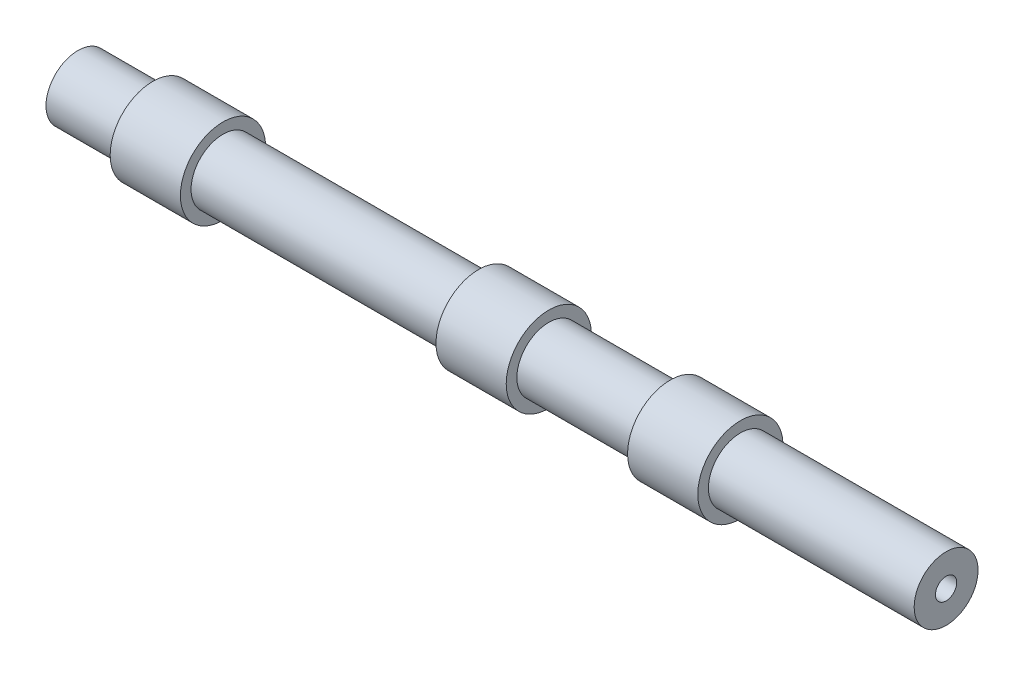
ISO-10303-21;
HEADER;
FILE_DESCRIPTION(('STEP AP214'),'2;1');
FILE_NAME('part.step','',(''),(''),'','','');
FILE_SCHEMA(('AUTOMOTIVE_DESIGN { 1 0 10303 214 1 1 1 1 }'));
ENDSEC;
DATA;
#1=APPLICATION_CONTEXT('core data for automotive mechanical design processes');
#2=APPLICATION_PROTOCOL_DEFINITION('international standard','automotive_design',2000,#1);
#3=PRODUCT_CONTEXT('',#1,'mechanical');
#4=PRODUCT('Part','Part','',(#3));
#5=PRODUCT_RELATED_PRODUCT_CATEGORY('part','',(#4));
#6=PRODUCT_DEFINITION_FORMATION('','',#4);
#7=PRODUCT_DEFINITION_CONTEXT('part definition',#1,'design');
#8=PRODUCT_DEFINITION('design','',#6,#7);
#9=PRODUCT_DEFINITION_SHAPE('','',#8);
#10=(LENGTH_UNIT() NAMED_UNIT(*) SI_UNIT(.MILLI.,.METRE.));
#11=(NAMED_UNIT(*) PLANE_ANGLE_UNIT() SI_UNIT($,.RADIAN.));
#12=(NAMED_UNIT(*) SI_UNIT($,.STERADIAN.) SOLID_ANGLE_UNIT());
#13=UNCERTAINTY_MEASURE_WITH_UNIT(LENGTH_MEASURE(1.E-05),#10,'distance_accuracy_value','');
#14=(GEOMETRIC_REPRESENTATION_CONTEXT(3) GLOBAL_UNCERTAINTY_ASSIGNED_CONTEXT((#13)) GLOBAL_UNIT_ASSIGNED_CONTEXT((#10,
#11,#12)) REPRESENTATION_CONTEXT('',''));
#15=CARTESIAN_POINT('',(0.,0.,0.));
#16=DIRECTION('',(0.,0.,1.));
#17=DIRECTION('',(1.,0.,0.));
#18=AXIS2_PLACEMENT_3D('',#15,#16,#17);
#19=CARTESIAN_POINT('',(-102.279792746114,0.,0.));
#20=DIRECTION('',(-1.,0.,0.));
#21=DIRECTION('',(0.,0.,1.));
#22=AXIS2_PLACEMENT_3D('',#19,#20,#21);
#23=CYLINDRICAL_SURFACE('',#22,5.);
#24=CARTESIAN_POINT('',(305.314834778905,0.,0.));
#25=DIRECTION('',(-1.,0.,0.));
#26=DIRECTION('',(0.,0.,1.));
#27=AXIS2_PLACEMENT_3D('',#24,#25,#26);
#28=CIRCLE('',#27,5.);
#29=CARTESIAN_POINT('',(305.314834778905,0.,5.));
#30=VERTEX_POINT('',#29);
#31=EDGE_CURVE('E119',#30,#30,#28,.T.);
#32=ORIENTED_EDGE('',*,*,#31,.F.);
#33=EDGE_LOOP('',(#32));
#34=FACE_BOUND('',#33,.T.);
#35=CARTESIAN_POINT('',(198.729740932642,0.,0.));
#36=DIRECTION('',(-1.,0.,0.));
#37=DIRECTION('',(0.,0.,1.));
#38=AXIS2_PLACEMENT_3D('',#35,#36,#37);
#39=CIRCLE('',#38,5.);
#40=CARTESIAN_POINT('',(198.729740932642,0.,5.));
#41=VERTEX_POINT('',#40);
#42=EDGE_CURVE('E10',#41,#41,#39,.T.);
#43=ORIENTED_EDGE('',*,*,#42,.T.);
#44=EDGE_LOOP('',(#43));
#45=FACE_BOUND('',#44,.T.);
#46=ADVANCED_FACE('F31',(#34,#45),#23,.F.);
#47=CARTESIAN_POINT('',(198.729740932642,20.,0.));
#48=DIRECTION('',(1.,0.,0.));
#49=DIRECTION('',(0.,0.,-1.));
#50=AXIS2_PLACEMENT_3D('',#47,#48,#49);
#51=PLANE('',#50);
#52=ORIENTED_EDGE('',*,*,#42,.F.);
#53=EDGE_LOOP('',(#52));
#54=FACE_BOUND('',#53,.T.);
#55=CARTESIAN_POINT('',(198.729740932642,0.,0.));
#56=DIRECTION('',(-1.,0.,0.));
#57=DIRECTION('',(0.,0.,1.));
#58=AXIS2_PLACEMENT_3D('',#55,#56,#57);
#59=CIRCLE('',#58,10.);
#60=CARTESIAN_POINT('',(198.729740932642,0.,10.));
#61=VERTEX_POINT('',#60);
#62=EDGE_CURVE('E37',#61,#61,#59,.T.);
#63=ORIENTED_EDGE('',*,*,#62,.T.);
#64=EDGE_LOOP('',(#63));
#65=FACE_BOUND('',#64,.T.);
#66=ADVANCED_FACE('F127',(#54,#65),#51,.F.);
#67=CARTESIAN_POINT('',(-102.279792746114,0.,0.));
#68=DIRECTION('',(-1.,0.,0.));
#69=DIRECTION('',(0.,0.,1.));
#70=AXIS2_PLACEMENT_3D('',#67,#68,#69);
#71=CYLINDRICAL_SURFACE('',#70,10.);
#72=ORIENTED_EDGE('',*,*,#62,.F.);
#73=EDGE_LOOP('',(#72));
#74=FACE_BOUND('',#73,.T.);
#75=CARTESIAN_POINT('',(185.759740932642,0.,0.));
#76=DIRECTION('',(-1.,0.,0.));
#77=DIRECTION('',(0.,0.,1.));
#78=AXIS2_PLACEMENT_3D('',#75,#76,#77);
#79=CIRCLE('',#78,10.);
#80=CARTESIAN_POINT('',(185.759740932642,0.,10.));
#81=VERTEX_POINT('',#80);
#82=EDGE_CURVE('E41',#81,#81,#79,.T.);
#83=ORIENTED_EDGE('',*,*,#82,.T.);
#84=EDGE_LOOP('',(#83));
#85=FACE_BOUND('',#84,.T.);
#86=ADVANCED_FACE('F131',(#74,#85),#71,.F.);
#87=CARTESIAN_POINT('',(185.759740932643,15.,0.));
#88=DIRECTION('',(-1.,0.,0.));
#89=DIRECTION('',(0.,0.,1.));
#90=AXIS2_PLACEMENT_3D('',#87,#88,#89);
#91=PLANE('',#90);
#92=ORIENTED_EDGE('',*,*,#82,.F.);
#93=EDGE_LOOP('',(#92));
#94=FACE_BOUND('',#93,.T.);
#95=CARTESIAN_POINT('',(185.759740932642,0.,0.));
#96=DIRECTION('',(-1.,0.,0.));
#97=DIRECTION('',(0.,0.,1.));
#98=AXIS2_PLACEMENT_3D('',#95,#96,#97);
#99=CIRCLE('',#98,5.);
#100=CARTESIAN_POINT('',(185.759740932642,0.,5.));
#101=VERTEX_POINT('',#100);
#102=EDGE_CURVE('E45',#101,#101,#99,.T.);
#103=ORIENTED_EDGE('',*,*,#102,.T.);
#104=EDGE_LOOP('',(#103));
#105=FACE_BOUND('',#104,.T.);
#106=ADVANCED_FACE('F136',(#94,#105),#91,.F.);
#107=CARTESIAN_POINT('',(-102.279792746114,0.,0.));
#108=DIRECTION('',(-1.,0.,0.));
#109=DIRECTION('',(0.,0.,1.));
#110=AXIS2_PLACEMENT_3D('',#107,#108,#109);
#111=CYLINDRICAL_SURFACE('',#110,5.);
#112=ORIENTED_EDGE('',*,*,#102,.F.);
#113=EDGE_LOOP('',(#112));
#114=FACE_BOUND('',#113,.T.);
#115=CARTESIAN_POINT('',(108.789740932642,0.,0.));
#116=DIRECTION('',(-1.,0.,0.));
#117=DIRECTION('',(0.,0.,1.));
#118=AXIS2_PLACEMENT_3D('',#115,#116,#117);
#119=CIRCLE('',#118,5.);
#120=CARTESIAN_POINT('',(108.789740932642,0.,5.));
#121=VERTEX_POINT('',#120);
#122=EDGE_CURVE('E50',#121,#121,#119,.T.);
#123=ORIENTED_EDGE('',*,*,#122,.T.);
#124=EDGE_LOOP('',(#123));
#125=FACE_BOUND('',#124,.T.);
#126=ADVANCED_FACE('F142',(#114,#125),#111,.F.);
#127=CARTESIAN_POINT('',(108.789740932642,20.,0.));
#128=DIRECTION('',(1.,0.,0.));
#129=DIRECTION('',(0.,0.,-1.));
#130=AXIS2_PLACEMENT_3D('',#127,#128,#129);
#131=PLANE('',#130);
#132=ORIENTED_EDGE('',*,*,#122,.F.);
#133=EDGE_LOOP('',(#132));
#134=FACE_BOUND('',#133,.T.);
#135=CARTESIAN_POINT('',(108.789740932642,0.,0.));
#136=DIRECTION('',(-1.,0.,0.));
#137=DIRECTION('',(0.,0.,1.));
#138=AXIS2_PLACEMENT_3D('',#135,#136,#137);
#139=CIRCLE('',#138,10.);
#140=CARTESIAN_POINT('',(108.789740932642,0.,10.));
#141=VERTEX_POINT('',#140);
#142=EDGE_CURVE('E53',#141,#141,#139,.T.);
#143=ORIENTED_EDGE('',*,*,#142,.T.);
#144=EDGE_LOOP('',(#143));
#145=FACE_BOUND('',#144,.T.);
#146=ADVANCED_FACE('F146',(#134,#145),#131,.F.);
#147=CARTESIAN_POINT('',(-102.279792746114,0.,0.));
#148=DIRECTION('',(-1.,0.,0.));
#149=DIRECTION('',(0.,0.,1.));
#150=AXIS2_PLACEMENT_3D('',#147,#148,#149);
#151=CYLINDRICAL_SURFACE('',#150,10.);
#152=ORIENTED_EDGE('',*,*,#142,.F.);
#153=EDGE_LOOP('',(#152));
#154=FACE_BOUND('',#153,.T.);
#155=CARTESIAN_POINT('',(95.8197409326425,0.,0.));
#156=DIRECTION('',(-1.,0.,0.));
#157=DIRECTION('',(0.,0.,1.));
#158=AXIS2_PLACEMENT_3D('',#155,#156,#157);
#159=CIRCLE('',#158,10.);
#160=CARTESIAN_POINT('',(95.8197409326425,0.,10.));
#161=VERTEX_POINT('',#160);
#162=EDGE_CURVE('E56',#161,#161,#159,.T.);
#163=ORIENTED_EDGE('',*,*,#162,.T.);
#164=EDGE_LOOP('',(#163));
#165=FACE_BOUND('',#164,.T.);
#166=ADVANCED_FACE('F150',(#154,#165),#151,.F.);
#167=CARTESIAN_POINT('',(95.8197409326425,15.,0.));
#168=DIRECTION('',(-1.,0.,0.));
#169=DIRECTION('',(0.,0.,1.));
#170=AXIS2_PLACEMENT_3D('',#167,#168,#169);
#171=PLANE('',#170);
#172=ORIENTED_EDGE('',*,*,#162,.F.);
#173=EDGE_LOOP('',(#172));
#174=FACE_BOUND('',#173,.T.);
#175=CARTESIAN_POINT('',(95.8197409326425,0.,0.));
#176=DIRECTION('',(-1.,0.,0.));
#177=DIRECTION('',(0.,0.,1.));
#178=AXIS2_PLACEMENT_3D('',#175,#176,#177);
#179=CIRCLE('',#178,5.);
#180=CARTESIAN_POINT('',(95.8197409326425,0.,5.));
#181=VERTEX_POINT('',#180);
#182=EDGE_CURVE('E59',#181,#181,#179,.T.);
#183=ORIENTED_EDGE('',*,*,#182,.T.);
#184=EDGE_LOOP('',(#183));
#185=FACE_BOUND('',#184,.T.);
#186=ADVANCED_FACE('F154',(#174,#185),#171,.F.);
#187=CARTESIAN_POINT('',(-102.279792746114,0.,0.));
#188=DIRECTION('',(-1.,0.,0.));
#189=DIRECTION('',(0.,0.,1.));
#190=AXIS2_PLACEMENT_3D('',#187,#188,#189);
#191=CYLINDRICAL_SURFACE('',#190,5.);
#192=ORIENTED_EDGE('',*,*,#182,.F.);
#193=EDGE_LOOP('',(#192));
#194=FACE_BOUND('',#193,.T.);
#195=CARTESIAN_POINT('',(-44.1802590673575,0.,0.));
#196=DIRECTION('',(-1.,0.,0.));
#197=DIRECTION('',(0.,0.,1.));
#198=AXIS2_PLACEMENT_3D('',#195,#196,#197);
#199=CIRCLE('',#198,5.);
#200=CARTESIAN_POINT('',(-44.1802590673575,0.,5.));
#201=VERTEX_POINT('',#200);
#202=EDGE_CURVE('E62',#201,#201,#199,.T.);
#203=ORIENTED_EDGE('',*,*,#202,.T.);
#204=EDGE_LOOP('',(#203));
#205=FACE_BOUND('',#204,.T.);
#206=ADVANCED_FACE('F158',(#194,#205),#191,.F.);
#207=CARTESIAN_POINT('',(-44.1802590673575,20.,0.));
#208=DIRECTION('',(1.,0.,0.));
#209=DIRECTION('',(0.,0.,-1.));
#210=AXIS2_PLACEMENT_3D('',#207,#208,#209);
#211=PLANE('',#210);
#212=ORIENTED_EDGE('',*,*,#202,.F.);
#213=EDGE_LOOP('',(#212));
#214=FACE_BOUND('',#213,.T.);
#215=CARTESIAN_POINT('',(-44.1802590673575,0.,0.));
#216=DIRECTION('',(-1.,0.,0.));
#217=DIRECTION('',(0.,0.,1.));
#218=AXIS2_PLACEMENT_3D('',#215,#216,#217);
#219=CIRCLE('',#218,10.);
#220=CARTESIAN_POINT('',(-44.1802590673575,0.,10.));
#221=VERTEX_POINT('',#220);
#222=EDGE_CURVE('E65',#221,#221,#219,.T.);
#223=ORIENTED_EDGE('',*,*,#222,.T.);
#224=EDGE_LOOP('',(#223));
#225=FACE_BOUND('',#224,.T.);
#226=ADVANCED_FACE('F162',(#214,#225),#211,.F.);
#227=CARTESIAN_POINT('',(-102.279792746114,0.,0.));
#228=DIRECTION('',(-1.,0.,0.));
#229=DIRECTION('',(0.,0.,1.));
#230=AXIS2_PLACEMENT_3D('',#227,#228,#229);
#231=CYLINDRICAL_SURFACE('',#230,10.);
#232=ORIENTED_EDGE('',*,*,#222,.F.);
#233=EDGE_LOOP('',(#232));
#234=FACE_BOUND('',#233,.T.);
#235=CARTESIAN_POINT('',(-57.1502590673575,0.,0.));
#236=DIRECTION('',(-1.,0.,0.));
#237=DIRECTION('',(0.,0.,1.));
#238=AXIS2_PLACEMENT_3D('',#235,#236,#237);
#239=CIRCLE('',#238,10.);
#240=CARTESIAN_POINT('',(-57.1502590673575,0.,10.));
#241=VERTEX_POINT('',#240);
#242=EDGE_CURVE('E68',#241,#241,#239,.T.);
#243=ORIENTED_EDGE('',*,*,#242,.T.);
#244=EDGE_LOOP('',(#243));
#245=FACE_BOUND('',#244,.T.);
#246=ADVANCED_FACE('F166',(#234,#245),#231,.F.);
#247=CARTESIAN_POINT('',(-57.1502590673575,15.,0.));
#248=DIRECTION('',(-1.,0.,0.));
#249=DIRECTION('',(0.,0.,1.));
#250=AXIS2_PLACEMENT_3D('',#247,#248,#249);
#251=PLANE('',#250);
#252=ORIENTED_EDGE('',*,*,#242,.F.);
#253=EDGE_LOOP('',(#252));
#254=FACE_BOUND('',#253,.T.);
#255=CARTESIAN_POINT('',(-57.1502590673575,0.,0.));
#256=DIRECTION('',(-1.,0.,0.));
#257=DIRECTION('',(0.,0.,1.));
#258=AXIS2_PLACEMENT_3D('',#255,#256,#257);
#259=CIRCLE('',#258,5.);
#260=CARTESIAN_POINT('',(-57.1502590673575,0.,5.));
#261=VERTEX_POINT('',#260);
#262=EDGE_CURVE('E71',#261,#261,#259,.T.);
#263=ORIENTED_EDGE('',*,*,#262,.T.);
#264=EDGE_LOOP('',(#263));
#265=FACE_BOUND('',#264,.T.);
#266=ADVANCED_FACE('F170',(#254,#265),#251,.F.);
#267=CARTESIAN_POINT('',(-102.279792746114,0.,0.));
#268=DIRECTION('',(-1.,0.,0.));
#269=DIRECTION('',(0.,0.,1.));
#270=AXIS2_PLACEMENT_3D('',#267,#268,#269);
#271=CYLINDRICAL_SURFACE('',#270,5.);
#272=ORIENTED_EDGE('',*,*,#262,.F.);
#273=EDGE_LOOP('',(#272));
#274=FACE_BOUND('',#273,.T.);
#275=CARTESIAN_POINT('',(-102.279792746114,0.,0.));
#276=DIRECTION('',(-1.,0.,0.));
#277=DIRECTION('',(0.,0.,1.));
#278=AXIS2_PLACEMENT_3D('',#275,#276,#277);
#279=CIRCLE('',#278,5.);
#280=CARTESIAN_POINT('',(-102.279792746114,0.,5.));
#281=VERTEX_POINT('',#280);
#282=EDGE_CURVE('E74',#281,#281,#279,.T.);
#283=ORIENTED_EDGE('',*,*,#282,.T.);
#284=EDGE_LOOP('',(#283));
#285=FACE_BOUND('',#284,.T.);
#286=ADVANCED_FACE('F174',(#274,#285),#271,.F.);
#287=CARTESIAN_POINT('',(-102.279792746114,5.,0.));
#288=DIRECTION('',(-1.,0.,0.));
#289=DIRECTION('',(0.,0.,1.));
#290=AXIS2_PLACEMENT_3D('',#287,#288,#289);
#291=PLANE('',#290);
#292=CARTESIAN_POINT('',(-102.279792746114,0.,0.));
#293=DIRECTION('',(-1.,0.,0.));
#294=DIRECTION('',(0.,0.,1.));
#295=AXIS2_PLACEMENT_3D('',#292,#293,#294);
#296=CIRCLE('',#295,15.);
#297=CARTESIAN_POINT('',(-102.279792746114,0.,15.));
#298=VERTEX_POINT('',#297);
#299=EDGE_CURVE('E77',#298,#298,#296,.T.);
#300=ORIENTED_EDGE('',*,*,#299,.T.);
#301=EDGE_LOOP('',(#300));
#302=FACE_BOUND('',#301,.T.);
#303=ORIENTED_EDGE('',*,*,#282,.F.);
#304=EDGE_LOOP('',(#303));
#305=FACE_BOUND('',#304,.T.);
#306=ADVANCED_FACE('F178',(#302,#305),#291,.T.);
#307=CARTESIAN_POINT('',(-102.279792746114,0.,0.));
#308=DIRECTION('',(-1.,0.,0.));
#309=DIRECTION('',(0.,0.,1.));
#310=AXIS2_PLACEMENT_3D('',#307,#308,#309);
#311=CYLINDRICAL_SURFACE('',#310,15.);
#312=CARTESIAN_POINT('',(-67.1502590673575,0.,0.));
#313=DIRECTION('',(-1.,0.,0.));
#314=DIRECTION('',(0.,0.,1.));
#315=AXIS2_PLACEMENT_3D('',#312,#313,#314);
#316=CIRCLE('',#315,15.);
#317=CARTESIAN_POINT('',(-67.1502590673575,0.,15.));
#318=VERTEX_POINT('',#317);
#319=EDGE_CURVE('E80',#318,#318,#316,.T.);
#320=ORIENTED_EDGE('',*,*,#319,.T.);
#321=EDGE_LOOP('',(#320));
#322=FACE_BOUND('',#321,.T.);
#323=ORIENTED_EDGE('',*,*,#299,.F.);
#324=EDGE_LOOP('',(#323));
#325=FACE_BOUND('',#324,.T.);
#326=ADVANCED_FACE('F182',(#322,#325),#311,.T.);
#327=CARTESIAN_POINT('',(-67.1502590673575,15.,0.));
#328=DIRECTION('',(-1.,0.,0.));
#329=DIRECTION('',(0.,0.,1.));
#330=AXIS2_PLACEMENT_3D('',#327,#328,#329);
#331=PLANE('',#330);
#332=CARTESIAN_POINT('',(-67.1502590673575,0.,0.));
#333=DIRECTION('',(-1.,0.,0.));
#334=DIRECTION('',(0.,0.,1.));
#335=AXIS2_PLACEMENT_3D('',#332,#333,#334);
#336=CIRCLE('',#335,20.);
#337=CARTESIAN_POINT('',(-67.1502590673575,0.,20.));
#338=VERTEX_POINT('',#337);
#339=EDGE_CURVE('E83',#338,#338,#336,.T.);
#340=ORIENTED_EDGE('',*,*,#339,.T.);
#341=EDGE_LOOP('',(#340));
#342=FACE_BOUND('',#341,.T.);
#343=ORIENTED_EDGE('',*,*,#319,.F.);
#344=EDGE_LOOP('',(#343));
#345=FACE_BOUND('',#344,.T.);
#346=ADVANCED_FACE('F186',(#342,#345),#331,.T.);
#347=CARTESIAN_POINT('',(-102.279792746114,0.,0.));
#348=DIRECTION('',(-1.,0.,0.));
#349=DIRECTION('',(0.,0.,1.));
#350=AXIS2_PLACEMENT_3D('',#347,#348,#349);
#351=CYLINDRICAL_SURFACE('',#350,20.);
#352=CARTESIAN_POINT('',(-34.1802590673575,0.,0.));
#353=DIRECTION('',(-1.,0.,0.));
#354=DIRECTION('',(0.,0.,1.));
#355=AXIS2_PLACEMENT_3D('',#352,#353,#354);
#356=CIRCLE('',#355,20.);
#357=CARTESIAN_POINT('',(-34.1802590673575,0.,20.));
#358=VERTEX_POINT('',#357);
#359=EDGE_CURVE('E86',#358,#358,#356,.T.);
#360=ORIENTED_EDGE('',*,*,#359,.T.);
#361=EDGE_LOOP('',(#360));
#362=FACE_BOUND('',#361,.T.);
#363=ORIENTED_EDGE('',*,*,#339,.F.);
#364=EDGE_LOOP('',(#363));
#365=FACE_BOUND('',#364,.T.);
#366=ADVANCED_FACE('F190',(#362,#365),#351,.T.);
#367=CARTESIAN_POINT('',(-34.1802590673575,20.,0.));
#368=DIRECTION('',(1.,0.,0.));
#369=DIRECTION('',(0.,0.,-1.));
#370=AXIS2_PLACEMENT_3D('',#367,#368,#369);
#371=PLANE('',#370);
#372=CARTESIAN_POINT('',(-34.1802590673575,0.,0.));
#373=DIRECTION('',(-1.,0.,0.));
#374=DIRECTION('',(0.,0.,1.));
#375=AXIS2_PLACEMENT_3D('',#372,#373,#374);
#376=CIRCLE('',#375,15.);
#377=CARTESIAN_POINT('',(-34.1802590673575,0.,15.));
#378=VERTEX_POINT('',#377);
#379=EDGE_CURVE('E89',#378,#378,#376,.T.);
#380=ORIENTED_EDGE('',*,*,#379,.T.);
#381=EDGE_LOOP('',(#380));
#382=FACE_BOUND('',#381,.T.);
#383=ORIENTED_EDGE('',*,*,#359,.F.);
#384=EDGE_LOOP('',(#383));
#385=FACE_BOUND('',#384,.T.);
#386=ADVANCED_FACE('F194',(#382,#385),#371,.T.);
#387=CARTESIAN_POINT('',(-102.279792746114,0.,0.));
#388=DIRECTION('',(-1.,0.,0.));
#389=DIRECTION('',(0.,0.,1.));
#390=AXIS2_PLACEMENT_3D('',#387,#388,#389);
#391=CYLINDRICAL_SURFACE('',#390,15.);
#392=CARTESIAN_POINT('',(85.8197409326425,0.,0.));
#393=DIRECTION('',(-1.,0.,0.));
#394=DIRECTION('',(0.,0.,1.));
#395=AXIS2_PLACEMENT_3D('',#392,#393,#394);
#396=CIRCLE('',#395,15.);
#397=CARTESIAN_POINT('',(85.8197409326425,0.,15.));
#398=VERTEX_POINT('',#397);
#399=EDGE_CURVE('E92',#398,#398,#396,.T.);
#400=ORIENTED_EDGE('',*,*,#399,.T.);
#401=EDGE_LOOP('',(#400));
#402=FACE_BOUND('',#401,.T.);
#403=ORIENTED_EDGE('',*,*,#379,.F.);
#404=EDGE_LOOP('',(#403));
#405=FACE_BOUND('',#404,.T.);
#406=ADVANCED_FACE('F198',(#402,#405),#391,.T.);
#407=CARTESIAN_POINT('',(85.8197409326425,15.,0.));
#408=DIRECTION('',(-1.,0.,0.));
#409=DIRECTION('',(0.,0.,1.));
#410=AXIS2_PLACEMENT_3D('',#407,#408,#409);
#411=PLANE('',#410);
#412=CARTESIAN_POINT('',(85.8197409326425,0.,0.));
#413=DIRECTION('',(-1.,0.,0.));
#414=DIRECTION('',(0.,0.,1.));
#415=AXIS2_PLACEMENT_3D('',#412,#413,#414);
#416=CIRCLE('',#415,20.);
#417=CARTESIAN_POINT('',(85.8197409326425,0.,20.));
#418=VERTEX_POINT('',#417);
#419=EDGE_CURVE('E95',#418,#418,#416,.T.);
#420=ORIENTED_EDGE('',*,*,#419,.T.);
#421=EDGE_LOOP('',(#420));
#422=FACE_BOUND('',#421,.T.);
#423=ORIENTED_EDGE('',*,*,#399,.F.);
#424=EDGE_LOOP('',(#423));
#425=FACE_BOUND('',#424,.T.);
#426=ADVANCED_FACE('F202',(#422,#425),#411,.T.);
#427=CARTESIAN_POINT('',(-102.279792746114,0.,0.));
#428=DIRECTION('',(-1.,0.,0.));
#429=DIRECTION('',(0.,0.,1.));
#430=AXIS2_PLACEMENT_3D('',#427,#428,#429);
#431=CYLINDRICAL_SURFACE('',#430,20.);
#432=CARTESIAN_POINT('',(118.789740932643,0.,0.));
#433=DIRECTION('',(-1.,0.,0.));
#434=DIRECTION('',(0.,0.,1.));
#435=AXIS2_PLACEMENT_3D('',#432,#433,#434);
#436=CIRCLE('',#435,20.);
#437=CARTESIAN_POINT('',(118.789740932643,0.,20.));
#438=VERTEX_POINT('',#437);
#439=EDGE_CURVE('E98',#438,#438,#436,.T.);
#440=ORIENTED_EDGE('',*,*,#439,.T.);
#441=EDGE_LOOP('',(#440));
#442=FACE_BOUND('',#441,.T.);
#443=ORIENTED_EDGE('',*,*,#419,.F.);
#444=EDGE_LOOP('',(#443));
#445=FACE_BOUND('',#444,.T.);
#446=ADVANCED_FACE('F206',(#442,#445),#431,.T.);
#447=CARTESIAN_POINT('',(118.789740932642,20.,0.));
#448=DIRECTION('',(1.,0.,0.));
#449=DIRECTION('',(0.,0.,-1.));
#450=AXIS2_PLACEMENT_3D('',#447,#448,#449);
#451=PLANE('',#450);
#452=CARTESIAN_POINT('',(118.789740932643,0.,0.));
#453=DIRECTION('',(-1.,0.,0.));
#454=DIRECTION('',(0.,0.,1.));
#455=AXIS2_PLACEMENT_3D('',#452,#453,#454);
#456=CIRCLE('',#455,15.);
#457=CARTESIAN_POINT('',(118.789740932643,0.,15.));
#458=VERTEX_POINT('',#457);
#459=EDGE_CURVE('E101',#458,#458,#456,.T.);
#460=ORIENTED_EDGE('',*,*,#459,.T.);
#461=EDGE_LOOP('',(#460));
#462=FACE_BOUND('',#461,.T.);
#463=ORIENTED_EDGE('',*,*,#439,.F.);
#464=EDGE_LOOP('',(#463));
#465=FACE_BOUND('',#464,.T.);
#466=ADVANCED_FACE('F210',(#462,#465),#451,.T.);
#467=CARTESIAN_POINT('',(-102.279792746114,0.,0.));
#468=DIRECTION('',(-1.,0.,0.));
#469=DIRECTION('',(0.,0.,1.));
#470=AXIS2_PLACEMENT_3D('',#467,#468,#469);
#471=CYLINDRICAL_SURFACE('',#470,15.);
#472=CARTESIAN_POINT('',(175.759740932642,0.,0.));
#473=DIRECTION('',(-1.,0.,0.));
#474=DIRECTION('',(0.,0.,1.));
#475=AXIS2_PLACEMENT_3D('',#472,#473,#474);
#476=CIRCLE('',#475,15.);
#477=CARTESIAN_POINT('',(175.759740932642,0.,15.));
#478=VERTEX_POINT('',#477);
#479=EDGE_CURVE('E104',#478,#478,#476,.T.);
#480=ORIENTED_EDGE('',*,*,#479,.T.);
#481=EDGE_LOOP('',(#480));
#482=FACE_BOUND('',#481,.T.);
#483=ORIENTED_EDGE('',*,*,#459,.F.);
#484=EDGE_LOOP('',(#483));
#485=FACE_BOUND('',#484,.T.);
#486=ADVANCED_FACE('F214',(#482,#485),#471,.T.);
#487=CARTESIAN_POINT('',(175.759740932643,15.,0.));
#488=DIRECTION('',(-1.,0.,0.));
#489=DIRECTION('',(0.,0.,1.));
#490=AXIS2_PLACEMENT_3D('',#487,#488,#489);
#491=PLANE('',#490);
#492=CARTESIAN_POINT('',(175.759740932642,0.,0.));
#493=DIRECTION('',(-1.,0.,0.));
#494=DIRECTION('',(0.,0.,1.));
#495=AXIS2_PLACEMENT_3D('',#492,#493,#494);
#496=CIRCLE('',#495,20.);
#497=CARTESIAN_POINT('',(175.759740932642,0.,20.));
#498=VERTEX_POINT('',#497);
#499=EDGE_CURVE('E107',#498,#498,#496,.T.);
#500=ORIENTED_EDGE('',*,*,#499,.T.);
#501=EDGE_LOOP('',(#500));
#502=FACE_BOUND('',#501,.T.);
#503=ORIENTED_EDGE('',*,*,#479,.F.);
#504=EDGE_LOOP('',(#503));
#505=FACE_BOUND('',#504,.T.);
#506=ADVANCED_FACE('F218',(#502,#505),#491,.T.);
#507=CARTESIAN_POINT('',(-102.279792746114,0.,0.));
#508=DIRECTION('',(-1.,0.,0.));
#509=DIRECTION('',(0.,0.,1.));
#510=AXIS2_PLACEMENT_3D('',#507,#508,#509);
#511=CYLINDRICAL_SURFACE('',#510,20.);
#512=CARTESIAN_POINT('',(208.729740932643,0.,0.));
#513=DIRECTION('',(-1.,0.,0.));
#514=DIRECTION('',(0.,0.,1.));
#515=AXIS2_PLACEMENT_3D('',#512,#513,#514);
#516=CIRCLE('',#515,20.);
#517=CARTESIAN_POINT('',(208.729740932643,0.,20.));
#518=VERTEX_POINT('',#517);
#519=EDGE_CURVE('E110',#518,#518,#516,.T.);
#520=ORIENTED_EDGE('',*,*,#519,.T.);
#521=EDGE_LOOP('',(#520));
#522=FACE_BOUND('',#521,.T.);
#523=ORIENTED_EDGE('',*,*,#499,.F.);
#524=EDGE_LOOP('',(#523));
#525=FACE_BOUND('',#524,.T.);
#526=ADVANCED_FACE('F222',(#522,#525),#511,.T.);
#527=CARTESIAN_POINT('',(208.729740932642,20.,0.));
#528=DIRECTION('',(1.,0.,0.));
#529=DIRECTION('',(0.,0.,-1.));
#530=AXIS2_PLACEMENT_3D('',#527,#528,#529);
#531=PLANE('',#530);
#532=CARTESIAN_POINT('',(208.729740932643,0.,0.));
#533=DIRECTION('',(-1.,0.,0.));
#534=DIRECTION('',(0.,0.,1.));
#535=AXIS2_PLACEMENT_3D('',#532,#533,#534);
#536=CIRCLE('',#535,15.);
#537=CARTESIAN_POINT('',(208.729740932643,0.,15.));
#538=VERTEX_POINT('',#537);
#539=EDGE_CURVE('E113',#538,#538,#536,.T.);
#540=ORIENTED_EDGE('',*,*,#539,.T.);
#541=EDGE_LOOP('',(#540));
#542=FACE_BOUND('',#541,.T.);
#543=ORIENTED_EDGE('',*,*,#519,.F.);
#544=EDGE_LOOP('',(#543));
#545=FACE_BOUND('',#544,.T.);
#546=ADVANCED_FACE('F226',(#542,#545),#531,.T.);
#547=CARTESIAN_POINT('',(-102.279792746114,0.,0.));
#548=DIRECTION('',(-1.,0.,0.));
#549=DIRECTION('',(0.,0.,1.));
#550=AXIS2_PLACEMENT_3D('',#547,#548,#549);
#551=CYLINDRICAL_SURFACE('',#550,15.);
#552=CARTESIAN_POINT('',(305.314834778905,0.,0.));
#553=DIRECTION('',(-1.,0.,0.));
#554=DIRECTION('',(0.,0.,1.));
#555=AXIS2_PLACEMENT_3D('',#552,#553,#554);
#556=CIRCLE('',#555,15.);
#557=CARTESIAN_POINT('',(305.314834778905,0.,15.));
#558=VERTEX_POINT('',#557);
#559=EDGE_CURVE('E116',#558,#558,#556,.T.);
#560=ORIENTED_EDGE('',*,*,#559,.T.);
#561=EDGE_LOOP('',(#560));
#562=FACE_BOUND('',#561,.T.);
#563=ORIENTED_EDGE('',*,*,#539,.F.);
#564=EDGE_LOOP('',(#563));
#565=FACE_BOUND('',#564,.T.);
#566=ADVANCED_FACE('F230',(#562,#565),#551,.T.);
#567=CARTESIAN_POINT('',(305.314834778905,15.,0.));
#568=DIRECTION('',(1.,0.,0.));
#569=DIRECTION('',(0.,0.,-1.));
#570=AXIS2_PLACEMENT_3D('',#567,#568,#569);
#571=PLANE('',#570);
#572=ORIENTED_EDGE('',*,*,#31,.T.);
#573=EDGE_LOOP('',(#572));
#574=FACE_BOUND('',#573,.T.);
#575=ORIENTED_EDGE('',*,*,#559,.F.);
#576=EDGE_LOOP('',(#575));
#577=FACE_BOUND('',#576,.T.);
#578=ADVANCED_FACE('F123',(#574,#577),#571,.T.);
#579=CLOSED_SHELL('',(#46,#66,#86,#106,#126,#146,#166,#186,#206,#226,#246,#266,#286,#306,#326,
#346,#366,#386,#406,#426,#446,#466,#486,#506,#526,#546,#566,#578));
#580=MANIFOLD_SOLID_BREP('B2',#579);
#581=ADVANCED_BREP_SHAPE_REPRESENTATION('',(#18,#580),#14);
#582=SHAPE_DEFINITION_REPRESENTATION(#9,#581);
ENDSEC;
END-ISO-10303-21;
